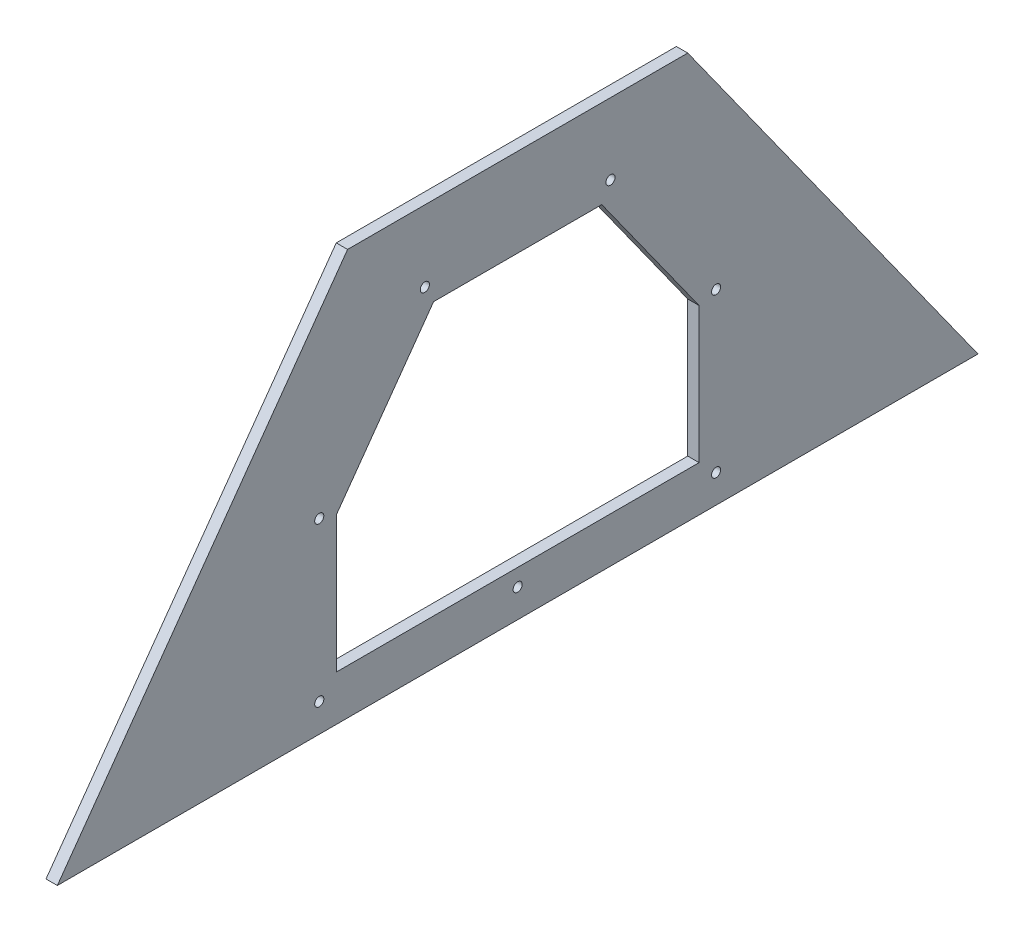
ISO-10303-21;
HEADER;
FILE_DESCRIPTION(('STEP AP214'),'2;1');
FILE_NAME('part.step','',(''),(''),'','','');
FILE_SCHEMA(('AUTOMOTIVE_DESIGN { 1 0 10303 214 1 1 1 1 }'));
ENDSEC;
DATA;
#1=APPLICATION_CONTEXT('core data for automotive mechanical design processes');
#2=APPLICATION_PROTOCOL_DEFINITION('international standard','automotive_design',2000,#1);
#3=PRODUCT_CONTEXT('',#1,'mechanical');
#4=PRODUCT('Part','Part','',(#3));
#5=PRODUCT_RELATED_PRODUCT_CATEGORY('part','',(#4));
#6=PRODUCT_DEFINITION_FORMATION('','',#4);
#7=PRODUCT_DEFINITION_CONTEXT('part definition',#1,'design');
#8=PRODUCT_DEFINITION('design','',#6,#7);
#9=PRODUCT_DEFINITION_SHAPE('','',#8);
#10=(LENGTH_UNIT() NAMED_UNIT(*) SI_UNIT(.MILLI.,.METRE.));
#11=(NAMED_UNIT(*) PLANE_ANGLE_UNIT() SI_UNIT($,.RADIAN.));
#12=(NAMED_UNIT(*) SI_UNIT($,.STERADIAN.) SOLID_ANGLE_UNIT());
#13=UNCERTAINTY_MEASURE_WITH_UNIT(LENGTH_MEASURE(1.E-05),#10,'distance_accuracy_value','');
#14=(GEOMETRIC_REPRESENTATION_CONTEXT(3) GLOBAL_UNCERTAINTY_ASSIGNED_CONTEXT((#13)) GLOBAL_UNIT_ASSIGNED_CONTEXT((#10,
#11,#12)) REPRESENTATION_CONTEXT('',''));
#15=CARTESIAN_POINT('',(0.,0.,0.));
#16=DIRECTION('',(0.,0.,1.));
#17=DIRECTION('',(1.,0.,0.));
#18=AXIS2_PLACEMENT_3D('',#15,#16,#17);
#19=CARTESIAN_POINT('',(6.35,0.,257.81));
#20=DIRECTION('',(0.,-0.581818181818182,-0.813318881685274));
#21=DIRECTION('',(0.,0.813318881685274,-0.581818181818182));
#22=AXIS2_PLACEMENT_3D('',#19,#20,#21);
#23=PLANE('',#22);
#24=DIRECTION('',(0.,-0.813318881685274,0.581818181818182));
#25=VECTOR('',#24,1.);
#26=CARTESIAN_POINT('',(0.,0.,257.81));
#27=LINE('',#26,#25);
#28=CARTESIAN_POINT('',(0.,227.241295542866,95.25));
#29=VERTEX_POINT('',#28);
#30=CARTESIAN_POINT('',(0.,0.,257.81));
#31=VERTEX_POINT('',#30);
#32=EDGE_CURVE('E157',#29,#31,#27,.T.);
#33=ORIENTED_EDGE('',*,*,#32,.T.);
#34=DIRECTION('',(-1.,0.,0.));
#35=VECTOR('',#34,1.);
#36=CARTESIAN_POINT('',(6.35,0.,257.81));
#37=LINE('',#36,#35);
#38=CARTESIAN_POINT('',(6.35,0.,257.81));
#39=VERTEX_POINT('',#38);
#40=EDGE_CURVE('E11',#39,#31,#37,.T.);
#41=ORIENTED_EDGE('',*,*,#40,.F.);
#42=DIRECTION('',(0.,-0.813318881685274,0.581818181818182));
#43=VECTOR('',#42,1.);
#44=CARTESIAN_POINT('',(6.35,0.,257.81));
#45=LINE('',#44,#43);
#46=CARTESIAN_POINT('',(6.35,227.241295542866,95.25));
#47=VERTEX_POINT('',#46);
#48=EDGE_CURVE('E165',#47,#39,#45,.T.);
#49=ORIENTED_EDGE('',*,*,#48,.F.);
#50=DIRECTION('',(-1.,0.,0.));
#51=VECTOR('',#50,1.);
#52=CARTESIAN_POINT('',(6.35,227.241295542866,95.25));
#53=LINE('',#52,#51);
#54=EDGE_CURVE('E175',#47,#29,#53,.T.);
#55=ORIENTED_EDGE('',*,*,#54,.T.);
#56=EDGE_LOOP('',(#33,#41,#49,#55));
#57=FACE_BOUND('',#56,.T.);
#58=ADVANCED_FACE('F33',(#57),#23,.F.);
#59=CARTESIAN_POINT('',(6.35,0.,-257.81));
#60=DIRECTION('',(0.,1.,0.));
#61=DIRECTION('',(0.,0.,1.));
#62=AXIS2_PLACEMENT_3D('',#59,#60,#61);
#63=PLANE('',#62);
#64=DIRECTION('',(0.,0.,-1.));
#65=VECTOR('',#64,1.);
#66=CARTESIAN_POINT('',(0.,0.,-257.81));
#67=LINE('',#66,#65);
#68=CARTESIAN_POINT('',(0.,0.,-257.81));
#69=VERTEX_POINT('',#68);
#70=EDGE_CURVE('E178',#31,#69,#67,.T.);
#71=ORIENTED_EDGE('',*,*,#70,.T.);
#72=DIRECTION('',(-1.,0.,0.));
#73=VECTOR('',#72,1.);
#74=CARTESIAN_POINT('',(6.35,0.,-257.81));
#75=LINE('',#74,#73);
#76=CARTESIAN_POINT('',(6.35,0.,-257.81));
#77=VERTEX_POINT('',#76);
#78=EDGE_CURVE('E40',#77,#69,#75,.T.);
#79=ORIENTED_EDGE('',*,*,#78,.F.);
#80=DIRECTION('',(0.,0.,-1.));
#81=VECTOR('',#80,1.);
#82=CARTESIAN_POINT('',(6.35,0.,-257.81));
#83=LINE('',#82,#81);
#84=EDGE_CURVE('E168',#39,#77,#83,.T.);
#85=ORIENTED_EDGE('',*,*,#84,.F.);
#86=ORIENTED_EDGE('',*,*,#40,.T.);
#87=EDGE_LOOP('',(#71,#79,#85,#86));
#88=FACE_BOUND('',#87,.T.);
#89=ADVANCED_FACE('F206',(#88),#63,.F.);
#90=CARTESIAN_POINT('',(6.35,0.,-257.81));
#91=DIRECTION('',(0.,-0.581818181818182,0.813318881685274));
#92=DIRECTION('',(0.,-0.813318881685274,-0.581818181818182));
#93=AXIS2_PLACEMENT_3D('',#90,#91,#92);
#94=PLANE('',#93);
#95=DIRECTION('',(0.,0.813318881685274,0.581818181818182));
#96=VECTOR('',#95,1.);
#97=CARTESIAN_POINT('',(0.,0.,-257.81));
#98=LINE('',#97,#96);
#99=CARTESIAN_POINT('',(0.,227.241295542866,-95.25));
#100=VERTEX_POINT('',#99);
#101=EDGE_CURVE('E180',#69,#100,#98,.T.);
#102=ORIENTED_EDGE('',*,*,#101,.T.);
#103=DIRECTION('',(-1.,0.,0.));
#104=VECTOR('',#103,1.);
#105=CARTESIAN_POINT('',(6.35,227.241295542866,-95.25));
#106=LINE('',#105,#104);
#107=CARTESIAN_POINT('',(6.35,227.241295542866,-95.25));
#108=VERTEX_POINT('',#107);
#109=EDGE_CURVE('E185',#108,#100,#106,.T.);
#110=ORIENTED_EDGE('',*,*,#109,.F.);
#111=DIRECTION('',(0.,0.813318881685274,0.581818181818182));
#112=VECTOR('',#111,1.);
#113=CARTESIAN_POINT('',(6.35,0.,-257.81));
#114=LINE('',#113,#112);
#115=EDGE_CURVE('E171',#77,#108,#114,.T.);
#116=ORIENTED_EDGE('',*,*,#115,.F.);
#117=ORIENTED_EDGE('',*,*,#78,.T.);
#118=EDGE_LOOP('',(#102,#110,#116,#117));
#119=FACE_BOUND('',#118,.T.);
#120=ADVANCED_FACE('F192',(#119),#94,.F.);
#121=CARTESIAN_POINT('',(6.35,227.241295542866,95.25));
#122=DIRECTION('',(0.,-1.,0.));
#123=DIRECTION('',(0.,0.,-1.));
#124=AXIS2_PLACEMENT_3D('',#121,#122,#123);
#125=PLANE('',#124);
#126=DIRECTION('',(0.,0.,1.));
#127=VECTOR('',#126,1.);
#128=CARTESIAN_POINT('',(0.,227.241295542866,95.25));
#129=LINE('',#128,#127);
#130=EDGE_CURVE('E169',#100,#29,#129,.T.);
#131=ORIENTED_EDGE('',*,*,#130,.T.);
#132=ORIENTED_EDGE('',*,*,#54,.F.);
#133=DIRECTION('',(0.,0.,1.));
#134=VECTOR('',#133,1.);
#135=CARTESIAN_POINT('',(6.35,227.241295542866,95.25));
#136=LINE('',#135,#134);
#137=EDGE_CURVE('E173',#108,#47,#136,.T.);
#138=ORIENTED_EDGE('',*,*,#137,.F.);
#139=ORIENTED_EDGE('',*,*,#109,.T.);
#140=EDGE_LOOP('',(#131,#132,#138,#139));
#141=FACE_BOUND('',#140,.T.);
#142=ADVANCED_FACE('F199',(#141),#125,.F.);
#143=CARTESIAN_POINT('',(6.35,0.,0.));
#144=DIRECTION('',(1.,0.,0.));
#145=DIRECTION('',(0.,0.,-1.));
#146=AXIS2_PLACEMENT_3D('',#143,#144,#145);
#147=PLANE('',#146);
#148=CARTESIAN_POINT('',(6.35,187.325,-51.9867861117994));
#149=DIRECTION('',(1.,0.,0.));
#150=DIRECTION('',(0.,0.,-1.));
#151=AXIS2_PLACEMENT_3D('',#148,#149,#150);
#152=CIRCLE('',#151,2.55269999999999);
#153=CARTESIAN_POINT('',(6.35,187.325,-54.5394861117994));
#154=VERTEX_POINT('',#153);
#155=EDGE_CURVE('E276',#154,#154,#152,.T.);
#156=ORIENTED_EDGE('',*,*,#155,.F.);
#157=EDGE_LOOP('',(#156));
#158=FACE_BOUND('',#157,.T.);
#159=CARTESIAN_POINT('',(6.35,187.325,51.9867861117994));
#160=DIRECTION('',(1.,0.,0.));
#161=DIRECTION('',(0.,0.,-1.));
#162=AXIS2_PLACEMENT_3D('',#159,#160,#161);
#163=CIRCLE('',#162,2.55269999999999);
#164=CARTESIAN_POINT('',(6.35,187.325,49.4340861117994));
#165=VERTEX_POINT('',#164);
#166=EDGE_CURVE('E278',#165,#165,#163,.T.);
#167=ORIENTED_EDGE('',*,*,#166,.F.);
#168=EDGE_LOOP('',(#167));
#169=FACE_BOUND('',#168,.T.);
#170=CARTESIAN_POINT('',(6.35,104.656174089285,-111.125));
#171=DIRECTION('',(1.,0.,0.));
#172=DIRECTION('',(0.,0.,-1.));
#173=AXIS2_PLACEMENT_3D('',#170,#171,#172);
#174=CIRCLE('',#173,2.55270000000001);
#175=CARTESIAN_POINT('',(6.35,104.656174089285,-113.6777));
#176=VERTEX_POINT('',#175);
#177=EDGE_CURVE('E286',#176,#176,#174,.T.);
#178=ORIENTED_EDGE('',*,*,#177,.F.);
#179=EDGE_LOOP('',(#178));
#180=FACE_BOUND('',#179,.T.);
#181=CARTESIAN_POINT('',(6.35,15.8749999999999,-111.125));
#182=DIRECTION('',(1.,0.,0.));
#183=DIRECTION('',(0.,0.,-1.));
#184=AXIS2_PLACEMENT_3D('',#181,#182,#183);
#185=CIRCLE('',#184,2.5527);
#186=CARTESIAN_POINT('',(6.35,15.8749999999999,-113.6777));
#187=VERTEX_POINT('',#186);
#188=EDGE_CURVE('E292',#187,#187,#185,.T.);
#189=ORIENTED_EDGE('',*,*,#188,.F.);
#190=EDGE_LOOP('',(#189));
#191=FACE_BOUND('',#190,.T.);
#192=CARTESIAN_POINT('',(6.35,15.8749999999999,111.125));
#193=DIRECTION('',(1.,0.,0.));
#194=DIRECTION('',(0.,0.,-1.));
#195=AXIS2_PLACEMENT_3D('',#192,#193,#194);
#196=CIRCLE('',#195,2.5527);
#197=CARTESIAN_POINT('',(6.35,15.8749999999999,108.5723));
#198=VERTEX_POINT('',#197);
#199=EDGE_CURVE('E298',#198,#198,#196,.T.);
#200=ORIENTED_EDGE('',*,*,#199,.F.);
#201=EDGE_LOOP('',(#200));
#202=FACE_BOUND('',#201,.T.);
#203=CARTESIAN_POINT('',(6.35,104.656174089285,111.125));
#204=DIRECTION('',(1.,0.,0.));
#205=DIRECTION('',(0.,0.,-1.));
#206=AXIS2_PLACEMENT_3D('',#203,#204,#205);
#207=CIRCLE('',#206,2.55270000000001);
#208=CARTESIAN_POINT('',(6.35,104.656174089285,108.5723));
#209=VERTEX_POINT('',#208);
#210=EDGE_CURVE('E304',#209,#209,#207,.T.);
#211=ORIENTED_EDGE('',*,*,#210,.F.);
#212=EDGE_LOOP('',(#211));
#213=FACE_BOUND('',#212,.T.);
#214=CARTESIAN_POINT('',(6.35,15.8749999999999,0.));
#215=DIRECTION('',(1.,0.,0.));
#216=DIRECTION('',(0.,0.,-1.));
#217=AXIS2_PLACEMENT_3D('',#214,#215,#216);
#218=CIRCLE('',#217,2.5527);
#219=CARTESIAN_POINT('',(6.35,15.8749999999999,-2.55270000000001));
#220=VERTEX_POINT('',#219);
#221=EDGE_CURVE('E309',#220,#220,#218,.T.);
#222=ORIENTED_EDGE('',*,*,#221,.F.);
#223=EDGE_LOOP('',(#222));
#224=FACE_BOUND('',#223,.T.);
#225=DIRECTION('',(0.,1.,0.));
#226=VECTOR('',#225,1.);
#227=CARTESIAN_POINT('',(6.35,101.6,-101.6));
#228=LINE('',#227,#226);
#229=CARTESIAN_POINT('',(6.35,25.3999999999999,-101.6));
#230=VERTEX_POINT('',#229);
#231=CARTESIAN_POINT('',(6.35,101.6,-101.6));
#232=VERTEX_POINT('',#231);
#233=EDGE_CURVE('E47',#230,#232,#228,.T.);
#234=ORIENTED_EDGE('',*,*,#233,.F.);
#235=DIRECTION('',(0.,0.,-1.));
#236=VECTOR('',#235,1.);
#237=CARTESIAN_POINT('',(6.35,25.3999999999999,101.6));
#238=LINE('',#237,#236);
#239=CARTESIAN_POINT('',(6.35,25.3999999999999,101.6));
#240=VERTEX_POINT('',#239);
#241=EDGE_CURVE('E128',#240,#230,#238,.T.);
#242=ORIENTED_EDGE('',*,*,#241,.F.);
#243=DIRECTION('',(0.,-1.,0.));
#244=VECTOR('',#243,1.);
#245=CARTESIAN_POINT('',(6.35,101.6,101.6));
#246=LINE('',#245,#244);
#247=CARTESIAN_POINT('',(6.35,101.6,101.6));
#248=VERTEX_POINT('',#247);
#249=EDGE_CURVE('E131',#248,#240,#246,.T.);
#250=ORIENTED_EDGE('',*,*,#249,.F.);
#251=DIRECTION('',(0.,-0.813318881685274,0.581818181818182));
#252=VECTOR('',#251,1.);
#253=CARTESIAN_POINT('',(6.35,101.6,101.6));
#254=LINE('',#253,#252);
#255=CARTESIAN_POINT('',(6.35,177.8,47.0893443975135));
#256=VERTEX_POINT('',#255);
#257=EDGE_CURVE('E150',#256,#248,#254,.T.);
#258=ORIENTED_EDGE('',*,*,#257,.F.);
#259=DIRECTION('',(0.,0.,1.));
#260=VECTOR('',#259,1.);
#261=CARTESIAN_POINT('',(6.35,177.8,47.0893443975135));
#262=LINE('',#261,#260);
#263=CARTESIAN_POINT('',(6.35,177.8,-47.0893443975135));
#264=VERTEX_POINT('',#263);
#265=EDGE_CURVE('E147',#264,#256,#262,.T.);
#266=ORIENTED_EDGE('',*,*,#265,.F.);
#267=DIRECTION('',(0.,0.813318881685274,0.581818181818182));
#268=VECTOR('',#267,1.);
#269=CARTESIAN_POINT('',(6.35,177.8,-47.0893443975135));
#270=LINE('',#269,#268);
#271=EDGE_CURVE('E145',#232,#264,#270,.T.);
#272=ORIENTED_EDGE('',*,*,#271,.F.);
#273=EDGE_LOOP('',(#234,#242,#250,#258,#266,#272));
#274=FACE_BOUND('',#273,.T.);
#275=ORIENTED_EDGE('',*,*,#48,.T.);
#276=ORIENTED_EDGE('',*,*,#84,.T.);
#277=ORIENTED_EDGE('',*,*,#115,.T.);
#278=ORIENTED_EDGE('',*,*,#137,.T.);
#279=EDGE_LOOP('',(#275,#276,#277,#278));
#280=FACE_BOUND('',#279,.T.);
#281=ADVANCED_FACE('F205',(#158,#169,#180,#191,#202,#213,#224,#274,#280),#147,.T.);
#282=CARTESIAN_POINT('',(0.,0.,0.));
#283=DIRECTION('',(1.,0.,0.));
#284=DIRECTION('',(0.,0.,-1.));
#285=AXIS2_PLACEMENT_3D('',#282,#283,#284);
#286=PLANE('',#285);
#287=CARTESIAN_POINT('',(0.,187.325,-51.9867861117994));
#288=DIRECTION('',(1.,0.,0.));
#289=DIRECTION('',(0.,0.,-1.));
#290=AXIS2_PLACEMENT_3D('',#287,#288,#289);
#291=CIRCLE('',#290,2.55269999999999);
#292=CARTESIAN_POINT('',(0.,187.325,-54.5394861117994));
#293=VERTEX_POINT('',#292);
#294=EDGE_CURVE('E273',#293,#293,#291,.T.);
#295=ORIENTED_EDGE('',*,*,#294,.T.);
#296=EDGE_LOOP('',(#295));
#297=FACE_BOUND('',#296,.T.);
#298=CARTESIAN_POINT('',(0.,187.325,51.9867861117994));
#299=DIRECTION('',(1.,0.,0.));
#300=DIRECTION('',(0.,0.,-1.));
#301=AXIS2_PLACEMENT_3D('',#298,#299,#300);
#302=CIRCLE('',#301,2.55269999999999);
#303=CARTESIAN_POINT('',(0.,187.325,49.4340861117994));
#304=VERTEX_POINT('',#303);
#305=EDGE_CURVE('E283',#304,#304,#302,.T.);
#306=ORIENTED_EDGE('',*,*,#305,.T.);
#307=EDGE_LOOP('',(#306));
#308=FACE_BOUND('',#307,.T.);
#309=CARTESIAN_POINT('',(0.,104.656174089285,-111.125));
#310=DIRECTION('',(1.,0.,0.));
#311=DIRECTION('',(0.,0.,-1.));
#312=AXIS2_PLACEMENT_3D('',#309,#310,#311);
#313=CIRCLE('',#312,2.55270000000001);
#314=CARTESIAN_POINT('',(0.,104.656174089285,-113.6777));
#315=VERTEX_POINT('',#314);
#316=EDGE_CURVE('E289',#315,#315,#313,.T.);
#317=ORIENTED_EDGE('',*,*,#316,.T.);
#318=EDGE_LOOP('',(#317));
#319=FACE_BOUND('',#318,.T.);
#320=CARTESIAN_POINT('',(0.,15.8749999999999,-111.125));
#321=DIRECTION('',(1.,0.,0.));
#322=DIRECTION('',(0.,0.,-1.));
#323=AXIS2_PLACEMENT_3D('',#320,#321,#322);
#324=CIRCLE('',#323,2.5527);
#325=CARTESIAN_POINT('',(0.,15.8749999999999,-113.6777));
#326=VERTEX_POINT('',#325);
#327=EDGE_CURVE('E295',#326,#326,#324,.T.);
#328=ORIENTED_EDGE('',*,*,#327,.T.);
#329=EDGE_LOOP('',(#328));
#330=FACE_BOUND('',#329,.T.);
#331=CARTESIAN_POINT('',(0.,15.8749999999999,111.125));
#332=DIRECTION('',(1.,0.,0.));
#333=DIRECTION('',(0.,0.,-1.));
#334=AXIS2_PLACEMENT_3D('',#331,#332,#333);
#335=CIRCLE('',#334,2.5527);
#336=CARTESIAN_POINT('',(0.,15.8749999999999,108.5723));
#337=VERTEX_POINT('',#336);
#338=EDGE_CURVE('E301',#337,#337,#335,.T.);
#339=ORIENTED_EDGE('',*,*,#338,.T.);
#340=EDGE_LOOP('',(#339));
#341=FACE_BOUND('',#340,.T.);
#342=CARTESIAN_POINT('',(0.,104.656174089285,111.125));
#343=DIRECTION('',(1.,0.,0.));
#344=DIRECTION('',(0.,0.,-1.));
#345=AXIS2_PLACEMENT_3D('',#342,#343,#344);
#346=CIRCLE('',#345,2.55270000000001);
#347=CARTESIAN_POINT('',(0.,104.656174089285,108.5723));
#348=VERTEX_POINT('',#347);
#349=EDGE_CURVE('E307',#348,#348,#346,.T.);
#350=ORIENTED_EDGE('',*,*,#349,.T.);
#351=EDGE_LOOP('',(#350));
#352=FACE_BOUND('',#351,.T.);
#353=CARTESIAN_POINT('',(0.,15.8749999999999,0.));
#354=DIRECTION('',(1.,0.,0.));
#355=DIRECTION('',(0.,0.,-1.));
#356=AXIS2_PLACEMENT_3D('',#353,#354,#355);
#357=CIRCLE('',#356,2.5527);
#358=CARTESIAN_POINT('',(0.,15.8749999999999,-2.55270000000001));
#359=VERTEX_POINT('',#358);
#360=EDGE_CURVE('E134',#359,#359,#357,.T.);
#361=ORIENTED_EDGE('',*,*,#360,.T.);
#362=EDGE_LOOP('',(#361));
#363=FACE_BOUND('',#362,.T.);
#364=DIRECTION('',(0.,0.,-1.));
#365=VECTOR('',#364,1.);
#366=CARTESIAN_POINT('',(0.,25.3999999999999,101.6));
#367=LINE('',#366,#365);
#368=CARTESIAN_POINT('',(0.,25.3999999999999,101.6));
#369=VERTEX_POINT('',#368);
#370=CARTESIAN_POINT('',(0.,25.3999999999999,-101.6));
#371=VERTEX_POINT('',#370);
#372=EDGE_CURVE('E117',#369,#371,#367,.T.);
#373=ORIENTED_EDGE('',*,*,#372,.T.);
#374=DIRECTION('',(0.,1.,0.));
#375=VECTOR('',#374,1.);
#376=CARTESIAN_POINT('',(0.,101.6,-101.6));
#377=LINE('',#376,#375);
#378=CARTESIAN_POINT('',(0.,101.6,-101.6));
#379=VERTEX_POINT('',#378);
#380=EDGE_CURVE('E111',#371,#379,#377,.T.);
#381=ORIENTED_EDGE('',*,*,#380,.T.);
#382=DIRECTION('',(0.,0.813318881685274,0.581818181818182));
#383=VECTOR('',#382,1.);
#384=CARTESIAN_POINT('',(0.,177.8,-47.0893443975135));
#385=LINE('',#384,#383);
#386=CARTESIAN_POINT('',(0.,177.8,-47.0893443975135));
#387=VERTEX_POINT('',#386);
#388=EDGE_CURVE('E120',#379,#387,#385,.T.);
#389=ORIENTED_EDGE('',*,*,#388,.T.);
#390=DIRECTION('',(0.,0.,1.));
#391=VECTOR('',#390,1.);
#392=CARTESIAN_POINT('',(0.,177.8,47.0893443975135));
#393=LINE('',#392,#391);
#394=CARTESIAN_POINT('',(0.,177.8,47.0893443975135));
#395=VERTEX_POINT('',#394);
#396=EDGE_CURVE('E55',#387,#395,#393,.T.);
#397=ORIENTED_EDGE('',*,*,#396,.T.);
#398=DIRECTION('',(0.,-0.813318881685274,0.581818181818182));
#399=VECTOR('',#398,1.);
#400=CARTESIAN_POINT('',(0.,101.6,101.6));
#401=LINE('',#400,#399);
#402=CARTESIAN_POINT('',(0.,101.6,101.6));
#403=VERTEX_POINT('',#402);
#404=EDGE_CURVE('E138',#395,#403,#401,.T.);
#405=ORIENTED_EDGE('',*,*,#404,.T.);
#406=DIRECTION('',(0.,-1.,0.));
#407=VECTOR('',#406,1.);
#408=CARTESIAN_POINT('',(0.,101.6,101.6));
#409=LINE('',#408,#407);
#410=EDGE_CURVE('E141',#403,#369,#409,.T.);
#411=ORIENTED_EDGE('',*,*,#410,.T.);
#412=EDGE_LOOP('',(#373,#381,#389,#397,#405,#411));
#413=FACE_BOUND('',#412,.T.);
#414=ORIENTED_EDGE('',*,*,#32,.F.);
#415=ORIENTED_EDGE('',*,*,#130,.F.);
#416=ORIENTED_EDGE('',*,*,#101,.F.);
#417=ORIENTED_EDGE('',*,*,#70,.F.);
#418=EDGE_LOOP('',(#414,#415,#416,#417));
#419=FACE_BOUND('',#418,.T.);
#420=ADVANCED_FACE('F124',(#297,#308,#319,#330,#341,#352,#363,#413,#419),#286,.F.);
#421=CARTESIAN_POINT('',(0.,101.6,-101.6));
#422=DIRECTION('',(0.,0.,-1.));
#423=DIRECTION('',(0.,1.,0.));
#424=AXIS2_PLACEMENT_3D('',#421,#422,#423);
#425=PLANE('',#424);
#426=ORIENTED_EDGE('',*,*,#233,.T.);
#427=DIRECTION('',(1.,0.,0.));
#428=VECTOR('',#427,1.);
#429=CARTESIAN_POINT('',(0.,101.6,-101.6));
#430=LINE('',#429,#428);
#431=EDGE_CURVE('E107',#379,#232,#430,.T.);
#432=ORIENTED_EDGE('',*,*,#431,.F.);
#433=ORIENTED_EDGE('',*,*,#380,.F.);
#434=DIRECTION('',(1.,0.,0.));
#435=VECTOR('',#434,1.);
#436=CARTESIAN_POINT('',(0.,25.3999999999999,-101.6));
#437=LINE('',#436,#435);
#438=EDGE_CURVE('E155',#371,#230,#437,.T.);
#439=ORIENTED_EDGE('',*,*,#438,.T.);
#440=EDGE_LOOP('',(#426,#432,#433,#439));
#441=FACE_BOUND('',#440,.T.);
#442=ADVANCED_FACE('F109',(#441),#425,.F.);
#443=CARTESIAN_POINT('',(0.,25.3999999999999,101.6));
#444=DIRECTION('',(0.,-1.,0.));
#445=DIRECTION('',(0.,0.,-1.));
#446=AXIS2_PLACEMENT_3D('',#443,#444,#445);
#447=PLANE('',#446);
#448=ORIENTED_EDGE('',*,*,#241,.T.);
#449=ORIENTED_EDGE('',*,*,#438,.F.);
#450=ORIENTED_EDGE('',*,*,#372,.F.);
#451=DIRECTION('',(1.,0.,0.));
#452=VECTOR('',#451,1.);
#453=CARTESIAN_POINT('',(0.,25.3999999999999,101.6));
#454=LINE('',#453,#452);
#455=EDGE_CURVE('E158',#369,#240,#454,.T.);
#456=ORIENTED_EDGE('',*,*,#455,.T.);
#457=EDGE_LOOP('',(#448,#449,#450,#456));
#458=FACE_BOUND('',#457,.T.);
#459=ADVANCED_FACE('F224',(#458),#447,.F.);
#460=CARTESIAN_POINT('',(0.,101.6,101.6));
#461=DIRECTION('',(0.,0.,1.));
#462=DIRECTION('',(0.,-1.,0.));
#463=AXIS2_PLACEMENT_3D('',#460,#461,#462);
#464=PLANE('',#463);
#465=ORIENTED_EDGE('',*,*,#249,.T.);
#466=ORIENTED_EDGE('',*,*,#455,.F.);
#467=ORIENTED_EDGE('',*,*,#410,.F.);
#468=DIRECTION('',(1.,0.,0.));
#469=VECTOR('',#468,1.);
#470=CARTESIAN_POINT('',(0.,101.6,101.6));
#471=LINE('',#470,#469);
#472=EDGE_CURVE('E160',#403,#248,#471,.T.);
#473=ORIENTED_EDGE('',*,*,#472,.T.);
#474=EDGE_LOOP('',(#465,#466,#467,#473));
#475=FACE_BOUND('',#474,.T.);
#476=ADVANCED_FACE('F234',(#475),#464,.F.);
#477=CARTESIAN_POINT('',(0.,101.6,101.6));
#478=DIRECTION('',(0.,0.581818181818182,0.813318881685274));
#479=DIRECTION('',(0.,-0.813318881685274,0.581818181818182));
#480=AXIS2_PLACEMENT_3D('',#477,#478,#479);
#481=PLANE('',#480);
#482=ORIENTED_EDGE('',*,*,#257,.T.);
#483=ORIENTED_EDGE('',*,*,#472,.F.);
#484=ORIENTED_EDGE('',*,*,#404,.F.);
#485=DIRECTION('',(1.,0.,0.));
#486=VECTOR('',#485,1.);
#487=CARTESIAN_POINT('',(0.,177.8,47.0893443975135));
#488=LINE('',#487,#486);
#489=EDGE_CURVE('E162',#395,#256,#488,.T.);
#490=ORIENTED_EDGE('',*,*,#489,.T.);
#491=EDGE_LOOP('',(#482,#483,#484,#490));
#492=FACE_BOUND('',#491,.T.);
#493=ADVANCED_FACE('F231',(#492),#481,.F.);
#494=CARTESIAN_POINT('',(0.,177.8,47.0893443975135));
#495=DIRECTION('',(0.,1.,0.));
#496=DIRECTION('',(0.,0.,1.));
#497=AXIS2_PLACEMENT_3D('',#494,#495,#496);
#498=PLANE('',#497);
#499=ORIENTED_EDGE('',*,*,#265,.T.);
#500=ORIENTED_EDGE('',*,*,#489,.F.);
#501=ORIENTED_EDGE('',*,*,#396,.F.);
#502=DIRECTION('',(1.,0.,0.));
#503=VECTOR('',#502,1.);
#504=CARTESIAN_POINT('',(0.,177.8,-47.0893443975135));
#505=LINE('',#504,#503);
#506=EDGE_CURVE('E116',#387,#264,#505,.T.);
#507=ORIENTED_EDGE('',*,*,#506,.T.);
#508=EDGE_LOOP('',(#499,#500,#501,#507));
#509=FACE_BOUND('',#508,.T.);
#510=ADVANCED_FACE('F228',(#509),#498,.F.);
#511=CARTESIAN_POINT('',(0.,177.8,-47.0893443975135));
#512=DIRECTION('',(0.,0.581818181818182,-0.813318881685274));
#513=DIRECTION('',(0.,0.813318881685274,0.581818181818182));
#514=AXIS2_PLACEMENT_3D('',#511,#512,#513);
#515=PLANE('',#514);
#516=ORIENTED_EDGE('',*,*,#271,.T.);
#517=ORIENTED_EDGE('',*,*,#506,.F.);
#518=ORIENTED_EDGE('',*,*,#388,.F.);
#519=ORIENTED_EDGE('',*,*,#431,.T.);
#520=EDGE_LOOP('',(#516,#517,#518,#519));
#521=FACE_BOUND('',#520,.T.);
#522=ADVANCED_FACE('F121',(#521),#515,.F.);
#523=CARTESIAN_POINT('',(6.35,15.8749999999999,0.));
#524=DIRECTION('',(1.,0.,0.));
#525=DIRECTION('',(0.,0.,-1.));
#526=AXIS2_PLACEMENT_3D('',#523,#524,#525);
#527=CYLINDRICAL_SURFACE('',#526,2.5527);
#528=ORIENTED_EDGE('',*,*,#360,.F.);
#529=EDGE_LOOP('',(#528));
#530=FACE_BOUND('',#529,.T.);
#531=ORIENTED_EDGE('',*,*,#221,.T.);
#532=EDGE_LOOP('',(#531));
#533=FACE_BOUND('',#532,.T.);
#534=ADVANCED_FACE('F227',(#530,#533),#527,.F.);
#535=CARTESIAN_POINT('',(6.35,104.656174089285,111.125));
#536=DIRECTION('',(1.,0.,0.));
#537=DIRECTION('',(0.,0.,-1.));
#538=AXIS2_PLACEMENT_3D('',#535,#536,#537);
#539=CYLINDRICAL_SURFACE('',#538,2.55270000000001);
#540=ORIENTED_EDGE('',*,*,#349,.F.);
#541=EDGE_LOOP('',(#540));
#542=FACE_BOUND('',#541,.T.);
#543=ORIENTED_EDGE('',*,*,#210,.T.);
#544=EDGE_LOOP('',(#543));
#545=FACE_BOUND('',#544,.T.);
#546=ADVANCED_FACE('F244',(#542,#545),#539,.F.);
#547=CARTESIAN_POINT('',(6.35,15.8749999999999,111.125));
#548=DIRECTION('',(1.,0.,0.));
#549=DIRECTION('',(0.,0.,-1.));
#550=AXIS2_PLACEMENT_3D('',#547,#548,#549);
#551=CYLINDRICAL_SURFACE('',#550,2.5527);
#552=ORIENTED_EDGE('',*,*,#338,.F.);
#553=EDGE_LOOP('',(#552));
#554=FACE_BOUND('',#553,.T.);
#555=ORIENTED_EDGE('',*,*,#199,.T.);
#556=EDGE_LOOP('',(#555));
#557=FACE_BOUND('',#556,.T.);
#558=ADVANCED_FACE('F248',(#554,#557),#551,.F.);
#559=CARTESIAN_POINT('',(6.35,15.8749999999999,-111.125));
#560=DIRECTION('',(1.,0.,0.));
#561=DIRECTION('',(0.,0.,-1.));
#562=AXIS2_PLACEMENT_3D('',#559,#560,#561);
#563=CYLINDRICAL_SURFACE('',#562,2.5527);
#564=ORIENTED_EDGE('',*,*,#327,.F.);
#565=EDGE_LOOP('',(#564));
#566=FACE_BOUND('',#565,.T.);
#567=ORIENTED_EDGE('',*,*,#188,.T.);
#568=EDGE_LOOP('',(#567));
#569=FACE_BOUND('',#568,.T.);
#570=ADVANCED_FACE('F252',(#566,#569),#563,.F.);
#571=CARTESIAN_POINT('',(6.35,104.656174089285,-111.125));
#572=DIRECTION('',(1.,0.,0.));
#573=DIRECTION('',(0.,0.,-1.));
#574=AXIS2_PLACEMENT_3D('',#571,#572,#573);
#575=CYLINDRICAL_SURFACE('',#574,2.55270000000001);
#576=ORIENTED_EDGE('',*,*,#316,.F.);
#577=EDGE_LOOP('',(#576));
#578=FACE_BOUND('',#577,.T.);
#579=ORIENTED_EDGE('',*,*,#177,.T.);
#580=EDGE_LOOP('',(#579));
#581=FACE_BOUND('',#580,.T.);
#582=ADVANCED_FACE('F256',(#578,#581),#575,.F.);
#583=CARTESIAN_POINT('',(6.35,187.325,51.9867861117994));
#584=DIRECTION('',(1.,0.,0.));
#585=DIRECTION('',(0.,0.,-1.));
#586=AXIS2_PLACEMENT_3D('',#583,#584,#585);
#587=CYLINDRICAL_SURFACE('',#586,2.55269999999999);
#588=ORIENTED_EDGE('',*,*,#305,.F.);
#589=EDGE_LOOP('',(#588));
#590=FACE_BOUND('',#589,.T.);
#591=ORIENTED_EDGE('',*,*,#166,.T.);
#592=EDGE_LOOP('',(#591));
#593=FACE_BOUND('',#592,.T.);
#594=ADVANCED_FACE('F260',(#590,#593),#587,.F.);
#595=CARTESIAN_POINT('',(6.35,187.325,-51.9867861117994));
#596=DIRECTION('',(1.,0.,0.));
#597=DIRECTION('',(0.,0.,-1.));
#598=AXIS2_PLACEMENT_3D('',#595,#596,#597);
#599=CYLINDRICAL_SURFACE('',#598,2.55269999999999);
#600=ORIENTED_EDGE('',*,*,#294,.F.);
#601=EDGE_LOOP('',(#600));
#602=FACE_BOUND('',#601,.T.);
#603=ORIENTED_EDGE('',*,*,#155,.T.);
#604=EDGE_LOOP('',(#603));
#605=FACE_BOUND('',#604,.T.);
#606=ADVANCED_FACE('F264',(#602,#605),#599,.F.);
#607=CLOSED_SHELL('',(#58,#89,#120,#142,#281,#420,#442,#459,#476,#493,#510,#522,#534,#546,#558,
#570,#582,#594,#606));
#608=MANIFOLD_SOLID_BREP('B2',#607);
#609=ADVANCED_BREP_SHAPE_REPRESENTATION('',(#18,#608),#14);
#610=SHAPE_DEFINITION_REPRESENTATION(#9,#609);
ENDSEC;
END-ISO-10303-21;
